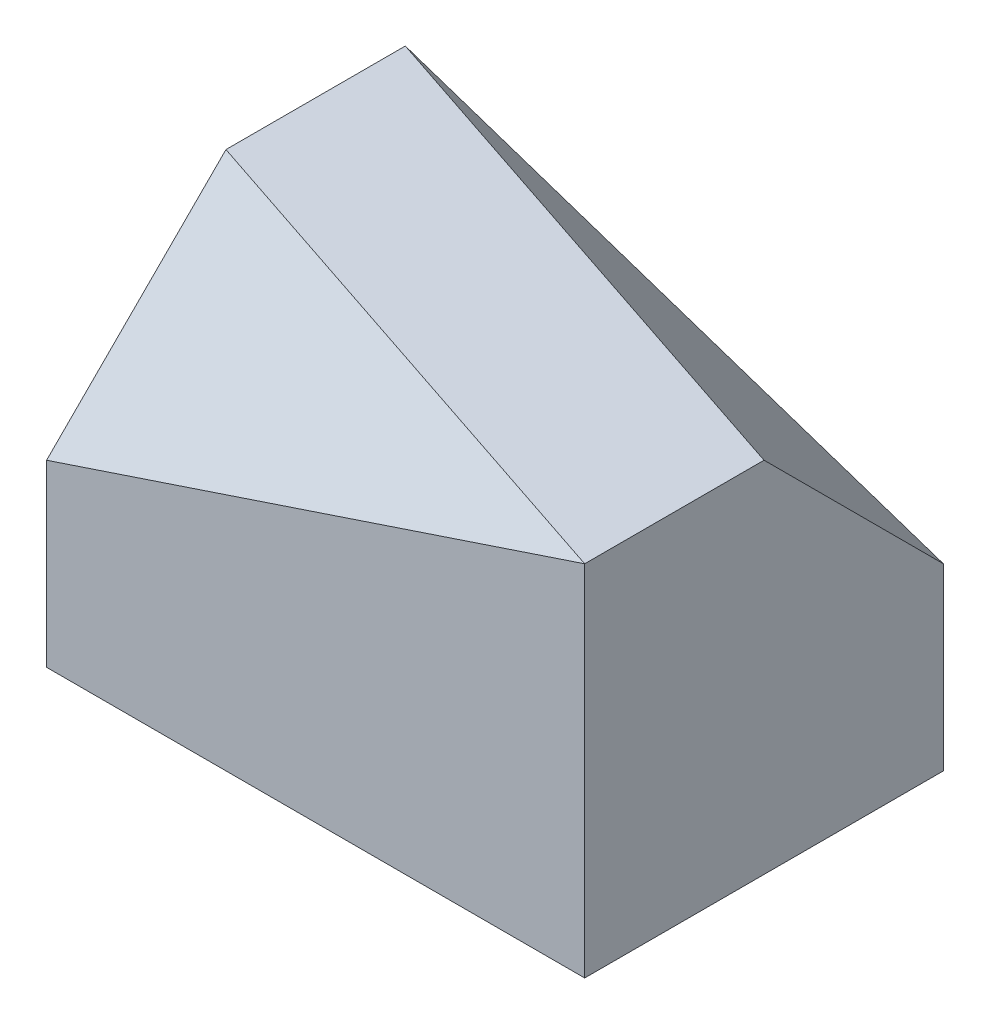
ISO-10303-21;
HEADER;
FILE_DESCRIPTION(('STEP AP214'),'2;1');
FILE_NAME('part.step','',(''),(''),'','','');
FILE_SCHEMA(('AUTOMOTIVE_DESIGN { 1 0 10303 214 1 1 1 1 }'));
ENDSEC;
DATA;
#1=APPLICATION_CONTEXT('core data for automotive mechanical design processes');
#2=APPLICATION_PROTOCOL_DEFINITION('international standard','automotive_design',2000,#1);
#3=PRODUCT_CONTEXT('',#1,'mechanical');
#4=PRODUCT('Part','Part','',(#3));
#5=PRODUCT_RELATED_PRODUCT_CATEGORY('part','',(#4));
#6=PRODUCT_DEFINITION_FORMATION('','',#4);
#7=PRODUCT_DEFINITION_CONTEXT('part definition',#1,'design');
#8=PRODUCT_DEFINITION('design','',#6,#7);
#9=PRODUCT_DEFINITION_SHAPE('','',#8);
#10=(LENGTH_UNIT() NAMED_UNIT(*) SI_UNIT(.MILLI.,.METRE.));
#11=(NAMED_UNIT(*) PLANE_ANGLE_UNIT() SI_UNIT($,.RADIAN.));
#12=(NAMED_UNIT(*) SI_UNIT($,.STERADIAN.) SOLID_ANGLE_UNIT());
#13=UNCERTAINTY_MEASURE_WITH_UNIT(LENGTH_MEASURE(1.E-05),#10,'distance_accuracy_value','');
#14=(GEOMETRIC_REPRESENTATION_CONTEXT(3) GLOBAL_UNCERTAINTY_ASSIGNED_CONTEXT((#13)) GLOBAL_UNIT_ASSIGNED_CONTEXT((#10,
#11,#12)) REPRESENTATION_CONTEXT('',''));
#15=CARTESIAN_POINT('',(0.,0.,0.));
#16=DIRECTION('',(0.,0.,1.));
#17=DIRECTION('',(1.,0.,0.));
#18=AXIS2_PLACEMENT_3D('',#15,#16,#17);
#19=CARTESIAN_POINT('',(15.,20.,10.));
#20=DIRECTION('',(-1.,0.,0.));
#21=DIRECTION('',(0.,0.,1.));
#22=AXIS2_PLACEMENT_3D('',#19,#20,#21);
#23=PLANE('',#22);
#24=DIRECTION('',(0.,-0.707106781186547,-0.707106781186548));
#25=VECTOR('',#24,1.);
#26=CARTESIAN_POINT('',(15.,25.,5.));
#27=LINE('',#26,#25);
#28=CARTESIAN_POINT('',(15.,20.,0.));
#29=VERTEX_POINT('',#28);
#30=CARTESIAN_POINT('',(15.,10.,-10.));
#31=VERTEX_POINT('',#30);
#32=EDGE_CURVE('E110',#29,#31,#27,.T.);
#33=ORIENTED_EDGE('',*,*,#32,.F.);
#34=DIRECTION('',(0.,0.,-1.));
#35=VECTOR('',#34,1.);
#36=CARTESIAN_POINT('',(15.,20.,10.));
#37=LINE('',#36,#35);
#38=CARTESIAN_POINT('',(15.,20.,10.));
#39=VERTEX_POINT('',#38);
#40=EDGE_CURVE('E97',#39,#29,#37,.T.);
#41=ORIENTED_EDGE('',*,*,#40,.F.);
#42=DIRECTION('',(0.,-1.,0.));
#43=VECTOR('',#42,1.);
#44=CARTESIAN_POINT('',(15.,20.,10.));
#45=LINE('',#44,#43);
#46=CARTESIAN_POINT('',(15.,0.,10.));
#47=VERTEX_POINT('',#46);
#48=EDGE_CURVE('E81',#39,#47,#45,.T.);
#49=ORIENTED_EDGE('',*,*,#48,.T.);
#50=DIRECTION('',(0.,0.,-1.));
#51=VECTOR('',#50,1.);
#52=CARTESIAN_POINT('',(15.,0.,10.));
#53=LINE('',#52,#51);
#54=CARTESIAN_POINT('',(15.,0.,-10.));
#55=VERTEX_POINT('',#54);
#56=EDGE_CURVE('E96',#47,#55,#53,.T.);
#57=ORIENTED_EDGE('',*,*,#56,.T.);
#58=DIRECTION('',(0.,-1.,0.));
#59=VECTOR('',#58,1.);
#60=CARTESIAN_POINT('',(15.,20.,-10.));
#61=LINE('',#60,#59);
#62=EDGE_CURVE('E106',#31,#55,#61,.T.);
#63=ORIENTED_EDGE('',*,*,#62,.F.);
#64=EDGE_LOOP('',(#33,#41,#49,#57,#63));
#65=FACE_BOUND('',#64,.T.);
#66=ADVANCED_FACE('F33',(#65),#23,.F.);
#67=CARTESIAN_POINT('',(-15.,20.,-10.));
#68=DIRECTION('',(0.,0.,1.));
#69=DIRECTION('',(1.,0.,0.));
#70=AXIS2_PLACEMENT_3D('',#67,#68,#69);
#71=PLANE('',#70);
#72=DIRECTION('',(-0.948683298050514,0.316227766016838,0.));
#73=VECTOR('',#72,1.);
#74=CARTESIAN_POINT('',(-15.,20.,-10.));
#75=LINE('',#74,#73);
#76=CARTESIAN_POINT('',(-15.,20.,-10.));
#77=VERTEX_POINT('',#76);
#78=EDGE_CURVE('E55',#31,#77,#75,.T.);
#79=ORIENTED_EDGE('',*,*,#78,.F.);
#80=ORIENTED_EDGE('',*,*,#62,.T.);
#81=DIRECTION('',(-1.,0.,0.));
#82=VECTOR('',#81,1.);
#83=CARTESIAN_POINT('',(-15.,0.,-10.));
#84=LINE('',#83,#82);
#85=CARTESIAN_POINT('',(-15.,0.,-10.));
#86=VERTEX_POINT('',#85);
#87=EDGE_CURVE('E91',#55,#86,#84,.T.);
#88=ORIENTED_EDGE('',*,*,#87,.T.);
#89=DIRECTION('',(0.,-1.,0.));
#90=VECTOR('',#89,1.);
#91=CARTESIAN_POINT('',(-15.,20.,-10.));
#92=LINE('',#91,#90);
#93=EDGE_CURVE('E80',#77,#86,#92,.T.);
#94=ORIENTED_EDGE('',*,*,#93,.F.);
#95=EDGE_LOOP('',(#79,#80,#88,#94));
#96=FACE_BOUND('',#95,.T.);
#97=ADVANCED_FACE('F130',(#96),#71,.F.);
#98=CARTESIAN_POINT('',(0.,20.,0.));
#99=DIRECTION('',(0.,-1.,0.));
#100=DIRECTION('',(0.,0.,-1.));
#101=AXIS2_PLACEMENT_3D('',#98,#99,#100);
#102=PLANE('',#101);
#103=DIRECTION('',(0.,0.,1.));
#104=VECTOR('',#103,1.);
#105=CARTESIAN_POINT('',(-15.,20.,10.));
#106=LINE('',#105,#104);
#107=CARTESIAN_POINT('',(-15.,20.,0.));
#108=VERTEX_POINT('',#107);
#109=EDGE_CURVE('E100',#77,#108,#106,.T.);
#110=ORIENTED_EDGE('',*,*,#109,.T.);
#111=DIRECTION('',(0.948683298050514,0.,0.316227766016838));
#112=VECTOR('',#111,1.);
#113=CARTESIAN_POINT('',(-1.5,20.,4.50000000000001));
#114=LINE('',#113,#112);
#115=EDGE_CURVE('E121',#108,#39,#114,.T.);
#116=ORIENTED_EDGE('',*,*,#115,.T.);
#117=ORIENTED_EDGE('',*,*,#40,.T.);
#118=DIRECTION('',(0.948683298050514,0.,0.316227766016838));
#119=VECTOR('',#118,1.);
#120=CARTESIAN_POINT('',(1.5,20.,-4.50000000000001));
#121=LINE('',#120,#119);
#122=EDGE_CURVE('E40',#77,#29,#121,.T.);
#123=ORIENTED_EDGE('',*,*,#122,.F.);
#124=EDGE_LOOP('',(#110,#116,#117,#123));
#125=FACE_BOUND('',#124,.T.);
#126=ADVANCED_FACE('F120',(#125),#102,.F.);
#127=CARTESIAN_POINT('',(-15.,20.,10.));
#128=DIRECTION('',(1.,0.,0.));
#129=DIRECTION('',(0.,0.,-1.));
#130=AXIS2_PLACEMENT_3D('',#127,#128,#129);
#131=PLANE('',#130);
#132=DIRECTION('',(0.,-1.,0.));
#133=VECTOR('',#132,1.);
#134=CARTESIAN_POINT('',(-15.,20.,10.));
#135=LINE('',#134,#133);
#136=CARTESIAN_POINT('',(-15.,10.,10.));
#137=VERTEX_POINT('',#136);
#138=CARTESIAN_POINT('',(-15.,0.,10.));
#139=VERTEX_POINT('',#138);
#140=EDGE_CURVE('E72',#137,#139,#135,.T.);
#141=ORIENTED_EDGE('',*,*,#140,.F.);
#142=DIRECTION('',(0.,0.707106781186547,-0.707106781186548));
#143=VECTOR('',#142,1.);
#144=CARTESIAN_POINT('',(-15.,15.,5.00000000000001));
#145=LINE('',#144,#143);
#146=EDGE_CURVE('E47',#137,#108,#145,.T.);
#147=ORIENTED_EDGE('',*,*,#146,.T.);
#148=ORIENTED_EDGE('',*,*,#109,.F.);
#149=ORIENTED_EDGE('',*,*,#93,.T.);
#150=DIRECTION('',(0.,0.,1.));
#151=VECTOR('',#150,1.);
#152=CARTESIAN_POINT('',(-15.,0.,10.));
#153=LINE('',#152,#151);
#154=EDGE_CURVE('E85',#86,#139,#153,.T.);
#155=ORIENTED_EDGE('',*,*,#154,.T.);
#156=EDGE_LOOP('',(#141,#147,#148,#149,#155));
#157=FACE_BOUND('',#156,.T.);
#158=ADVANCED_FACE('F86',(#157),#131,.F.);
#159=CARTESIAN_POINT('',(-15.,20.,10.));
#160=DIRECTION('',(0.,0.,-1.));
#161=DIRECTION('',(-1.,0.,0.));
#162=AXIS2_PLACEMENT_3D('',#159,#160,#161);
#163=PLANE('',#162);
#164=ORIENTED_EDGE('',*,*,#48,.F.);
#165=DIRECTION('',(-0.948683298050514,-0.316227766016838,0.));
#166=VECTOR('',#165,1.);
#167=CARTESIAN_POINT('',(-12.,11.,10.));
#168=LINE('',#167,#166);
#169=EDGE_CURVE('E11',#39,#137,#168,.T.);
#170=ORIENTED_EDGE('',*,*,#169,.T.);
#171=ORIENTED_EDGE('',*,*,#140,.T.);
#172=DIRECTION('',(1.,0.,0.));
#173=VECTOR('',#172,1.);
#174=CARTESIAN_POINT('',(-15.,0.,10.));
#175=LINE('',#174,#173);
#176=EDGE_CURVE('E77',#139,#47,#175,.T.);
#177=ORIENTED_EDGE('',*,*,#176,.T.);
#178=EDGE_LOOP('',(#164,#170,#171,#177));
#179=FACE_BOUND('',#178,.T.);
#180=ADVANCED_FACE('F75',(#179),#163,.F.);
#181=CARTESIAN_POINT('',(0.,0.,0.));
#182=DIRECTION('',(0.,-1.,0.));
#183=DIRECTION('',(0.,0.,-1.));
#184=AXIS2_PLACEMENT_3D('',#181,#182,#183);
#185=PLANE('',#184);
#186=ORIENTED_EDGE('',*,*,#56,.F.);
#187=ORIENTED_EDGE('',*,*,#176,.F.);
#188=ORIENTED_EDGE('',*,*,#154,.F.);
#189=ORIENTED_EDGE('',*,*,#87,.F.);
#190=EDGE_LOOP('',(#186,#187,#188,#189));
#191=FACE_BOUND('',#190,.T.);
#192=ADVANCED_FACE('F94',(#191),#185,.T.);
#193=CARTESIAN_POINT('',(3.94736842105263,11.8421052631579,-11.8421052631579));
#194=DIRECTION('',(0.229415733870562,0.688247201611686,-0.688247201611685));
#195=DIRECTION('',(0.,0.707106781186547,0.707106781186548));
#196=AXIS2_PLACEMENT_3D('',#193,#194,#195);
#197=PLANE('',#196);
#198=ORIENTED_EDGE('',*,*,#32,.T.);
#199=ORIENTED_EDGE('',*,*,#78,.T.);
#200=ORIENTED_EDGE('',*,*,#122,.T.);
#201=EDGE_LOOP('',(#198,#199,#200));
#202=FACE_BOUND('',#201,.T.);
#203=ADVANCED_FACE('F109',(#202),#197,.T.);
#204=CARTESIAN_POINT('',(-3.94736842105263,11.8421052631579,11.8421052631579));
#205=DIRECTION('',(0.229415733870562,-0.688247201611685,-0.688247201611685));
#206=DIRECTION('',(0.,0.707106781186547,-0.707106781186548));
#207=AXIS2_PLACEMENT_3D('',#204,#205,#206);
#208=PLANE('',#207);
#209=ORIENTED_EDGE('',*,*,#146,.F.);
#210=ORIENTED_EDGE('',*,*,#169,.F.);
#211=ORIENTED_EDGE('',*,*,#115,.F.);
#212=EDGE_LOOP('',(#209,#210,#211));
#213=FACE_BOUND('',#212,.T.);
#214=ADVANCED_FACE('F146',(#213),#208,.F.);
#215=CLOSED_SHELL('',(#66,#97,#126,#158,#180,#192,#203,#214));
#216=MANIFOLD_SOLID_BREP('B2',#215);
#217=ADVANCED_BREP_SHAPE_REPRESENTATION('',(#18,#216),#14);
#218=SHAPE_DEFINITION_REPRESENTATION(#9,#217);
ENDSEC;
END-ISO-10303-21;
